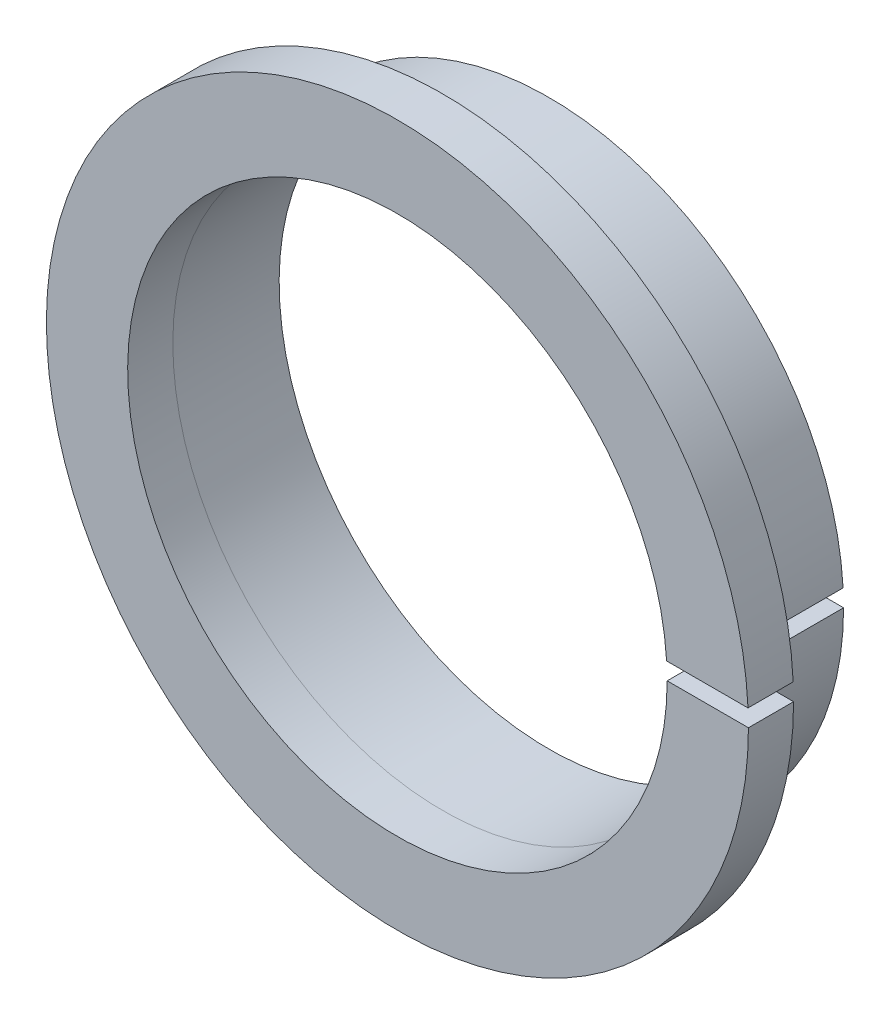
ISO-10303-21;
HEADER;
FILE_DESCRIPTION(('STEP AP214'),'2;1');
FILE_NAME('part.step','',(''),(''),'','','');
FILE_SCHEMA(('AUTOMOTIVE_DESIGN { 1 0 10303 214 1 1 1 1 }'));
ENDSEC;
DATA;
#1=APPLICATION_CONTEXT('core data for automotive mechanical design processes');
#2=APPLICATION_PROTOCOL_DEFINITION('international standard','automotive_design',2000,#1);
#3=PRODUCT_CONTEXT('',#1,'mechanical');
#4=PRODUCT('Part','Part','',(#3));
#5=PRODUCT_RELATED_PRODUCT_CATEGORY('part','',(#4));
#6=PRODUCT_DEFINITION_FORMATION('','',#4);
#7=PRODUCT_DEFINITION_CONTEXT('part definition',#1,'design');
#8=PRODUCT_DEFINITION('design','',#6,#7);
#9=PRODUCT_DEFINITION_SHAPE('','',#8);
#10=(LENGTH_UNIT() NAMED_UNIT(*) SI_UNIT(.MILLI.,.METRE.));
#11=(NAMED_UNIT(*) PLANE_ANGLE_UNIT() SI_UNIT($,.RADIAN.));
#12=(NAMED_UNIT(*) SI_UNIT($,.STERADIAN.) SOLID_ANGLE_UNIT());
#13=UNCERTAINTY_MEASURE_WITH_UNIT(LENGTH_MEASURE(1.E-05),#10,'distance_accuracy_value','');
#14=(GEOMETRIC_REPRESENTATION_CONTEXT(3) GLOBAL_UNCERTAINTY_ASSIGNED_CONTEXT((#13)) GLOBAL_UNIT_ASSIGNED_CONTEXT((#10,
#11,#12)) REPRESENTATION_CONTEXT('',''));
#15=CARTESIAN_POINT('',(0.,0.,0.));
#16=DIRECTION('',(0.,0.,1.));
#17=DIRECTION('',(1.,0.,0.));
#18=AXIS2_PLACEMENT_3D('',#15,#16,#17);
#19=CARTESIAN_POINT('',(-7.76463886416334E-06,-3.62104967429992E-07,-6.71));
#20=DIRECTION('',(0.,0.,1.));
#21=DIRECTION('',(1.,0.,0.));
#22=AXIS2_PLACEMENT_3D('',#19,#20,#21);
#23=CYLINDRICAL_SURFACE('',#22,11.9494490659713);
#24=CARTESIAN_POINT('',(-7.76463886416334E-06,-3.62104967429992E-07,-2.));
#25=DIRECTION('',(0.,0.,1.));
#26=DIRECTION('',(-1.,0.,0.));
#27=AXIS2_PLACEMENT_3D('',#24,#25,#26);
#28=CIRCLE('',#27,11.9494490659713);
#29=CARTESIAN_POINT('',(11.9258810776966,0.750005171541773,-2.));
#30=VERTEX_POINT('',#29);
#31=CARTESIAN_POINT('',(11.9494413013192,-1.81089741319822E-05,-2.));
#32=VERTEX_POINT('',#31);
#33=EDGE_CURVE('E112',#30,#32,#28,.T.);
#34=ORIENTED_EDGE('',*,*,#33,.T.);
#35=DIRECTION('',(0.,0.,1.));
#36=VECTOR('',#35,1.);
#37=CARTESIAN_POINT('',(11.9494413013192,-1.81089741319822E-05,-6.71));
#38=LINE('',#37,#36);
#39=CARTESIAN_POINT('',(11.9494413013192,-1.81089741319822E-05,-6.71));
#40=VERTEX_POINT('',#39);
#41=EDGE_CURVE('E12',#40,#32,#38,.T.);
#42=ORIENTED_EDGE('',*,*,#41,.F.);
#43=CARTESIAN_POINT('',(-7.76463886416334E-06,-3.62104967429992E-07,-6.71));
#44=DIRECTION('',(0.,0.,1.));
#45=DIRECTION('',(-1.,0.,0.));
#46=AXIS2_PLACEMENT_3D('',#43,#44,#45);
#47=CIRCLE('',#46,11.9494490659713);
#48=CARTESIAN_POINT('',(11.9258810776966,0.750005171541773,-6.71));
#49=VERTEX_POINT('',#48);
#50=EDGE_CURVE('E100',#49,#40,#47,.T.);
#51=ORIENTED_EDGE('',*,*,#50,.F.);
#52=DIRECTION('',(0.,0.,1.));
#53=VECTOR('',#52,1.);
#54=CARTESIAN_POINT('',(11.9258810776966,0.750005171541773,-6.71));
#55=LINE('',#54,#53);
#56=EDGE_CURVE('E108',#49,#30,#55,.T.);
#57=ORIENTED_EDGE('',*,*,#56,.T.);
#58=EDGE_LOOP('',(#34,#42,#51,#57));
#59=FACE_BOUND('',#58,.T.);
#60=ADVANCED_FACE('F49',(#59),#23,.F.);
#61=CARTESIAN_POINT('',(11.9494413013192,-1.81089741319822E-05,-6.71));
#62=DIRECTION('',(3.32628725026178E-05,-0.999999999446791,0.));
#63=DIRECTION('',(0.999999999446791,3.32628725026178E-05,0.));
#64=AXIS2_PLACEMENT_3D('',#61,#62,#63);
#65=PLANE('',#64);
#66=DIRECTION('',(0.999999999446791,3.32628725026178E-05,0.));
#67=VECTOR('',#66,1.);
#68=CARTESIAN_POINT('',(11.9494413013192,-1.81089741319822E-05,-2.));
#69=LINE('',#68,#67);
#70=CARTESIAN_POINT('',(13.0543939142499,1.86449237736986E-05,-2.));
#71=VERTEX_POINT('',#70);
#72=EDGE_CURVE('E104',#32,#71,#69,.T.);
#73=ORIENTED_EDGE('',*,*,#72,.T.);
#74=DIRECTION('',(0.,0.,1.));
#75=VECTOR('',#74,1.);
#76=CARTESIAN_POINT('',(13.0543939142499,1.86449237736986E-05,-6.71));
#77=LINE('',#76,#75);
#78=CARTESIAN_POINT('',(13.0543939142499,1.86449237736986E-05,-6.71));
#79=VERTEX_POINT('',#78);
#80=EDGE_CURVE('E57',#79,#71,#77,.T.);
#81=ORIENTED_EDGE('',*,*,#80,.F.);
#82=DIRECTION('',(0.999999999446791,3.32628725026178E-05,0.));
#83=VECTOR('',#82,1.);
#84=CARTESIAN_POINT('',(11.9494413013192,-1.81089741319822E-05,-6.71));
#85=LINE('',#84,#83);
#86=EDGE_CURVE('E95',#40,#79,#85,.T.);
#87=ORIENTED_EDGE('',*,*,#86,.F.);
#88=ORIENTED_EDGE('',*,*,#41,.T.);
#89=EDGE_LOOP('',(#73,#81,#87,#88));
#90=FACE_BOUND('',#89,.T.);
#91=ADVANCED_FACE('F103',(#90),#65,.F.);
#92=CARTESIAN_POINT('',(-8.76366281338057E-06,-4.04738164502353E-07,-6.71));
#93=DIRECTION('',(0.,0.,1.));
#94=DIRECTION('',(1.,0.,0.));
#95=AXIS2_PLACEMENT_3D('',#92,#93,#94);
#96=CYLINDRICAL_SURFACE('',#95,13.0544026779266);
#97=CARTESIAN_POINT('',(-8.76366281338057E-06,-4.04738164502353E-07,-2.));
#98=DIRECTION('',(0.,0.,-1.));
#99=DIRECTION('',(-1.,0.,0.));
#100=AXIS2_PLACEMENT_3D('',#97,#98,#99);
#101=CIRCLE('',#100,13.0544026779266);
#102=CARTESIAN_POINT('',(13.0328292112691,0.750041991816418,-2.));
#103=VERTEX_POINT('',#102);
#104=EDGE_CURVE('E82',#71,#103,#101,.T.);
#105=ORIENTED_EDGE('',*,*,#104,.T.);
#106=DIRECTION('',(0.,0.,1.));
#107=VECTOR('',#106,1.);
#108=CARTESIAN_POINT('',(13.0328292112691,0.750041991816418,-6.71));
#109=LINE('',#108,#107);
#110=CARTESIAN_POINT('',(13.0328292112691,0.750041991816418,-6.71));
#111=VERTEX_POINT('',#110);
#112=EDGE_CURVE('E105',#111,#103,#109,.T.);
#113=ORIENTED_EDGE('',*,*,#112,.F.);
#114=CARTESIAN_POINT('',(-8.76366281338057E-06,-4.04738164502353E-07,-6.71));
#115=DIRECTION('',(0.,0.,-1.));
#116=DIRECTION('',(-1.,0.,0.));
#117=AXIS2_PLACEMENT_3D('',#114,#115,#116);
#118=CIRCLE('',#117,13.0544026779266);
#119=EDGE_CURVE('E98',#79,#111,#118,.T.);
#120=ORIENTED_EDGE('',*,*,#119,.F.);
#121=ORIENTED_EDGE('',*,*,#80,.T.);
#122=EDGE_LOOP('',(#105,#113,#120,#121));
#123=FACE_BOUND('',#122,.T.);
#124=ADVANCED_FACE('F106',(#123),#96,.T.);
#125=CARTESIAN_POINT('',(13.0328292112691,0.750041991816428,-6.71));
#126=DIRECTION('',(-3.32628725027403E-05,0.999999999446791,0.));
#127=DIRECTION('',(-0.999999999446791,-3.32628725027403E-05,0.));
#128=AXIS2_PLACEMENT_3D('',#125,#126,#127);
#129=PLANE('',#128);
#130=DIRECTION('',(-0.999999999446791,-3.32628725027403E-05,0.));
#131=VECTOR('',#130,1.);
#132=CARTESIAN_POINT('',(13.0328292112691,0.750041991816428,-2.));
#133=LINE('',#132,#131);
#134=EDGE_CURVE('E88',#103,#30,#133,.T.);
#135=ORIENTED_EDGE('',*,*,#134,.T.);
#136=ORIENTED_EDGE('',*,*,#56,.F.);
#137=DIRECTION('',(-0.999999999446791,-3.32628725027403E-05,0.));
#138=VECTOR('',#137,1.);
#139=CARTESIAN_POINT('',(13.0328292112691,0.750041991816428,-6.71));
#140=LINE('',#139,#138);
#141=EDGE_CURVE('E65',#111,#49,#140,.T.);
#142=ORIENTED_EDGE('',*,*,#141,.F.);
#143=ORIENTED_EDGE('',*,*,#112,.T.);
#144=EDGE_LOOP('',(#135,#136,#142,#143));
#145=FACE_BOUND('',#144,.T.);
#146=ADVANCED_FACE('F119',(#145),#129,.F.);
#147=CARTESIAN_POINT('',(-7.76463886416334E-06,-3.62104967429992E-07,-6.71));
#148=DIRECTION('',(0.,0.,-1.));
#149=DIRECTION('',(-1.,0.,0.));
#150=AXIS2_PLACEMENT_3D('',#147,#148,#149);
#151=PLANE('',#150);
#152=ORIENTED_EDGE('',*,*,#50,.T.);
#153=ORIENTED_EDGE('',*,*,#86,.T.);
#154=ORIENTED_EDGE('',*,*,#119,.T.);
#155=ORIENTED_EDGE('',*,*,#141,.T.);
#156=EDGE_LOOP('',(#152,#153,#154,#155));
#157=FACE_BOUND('',#156,.T.);
#158=ADVANCED_FACE('F96',(#157),#151,.T.);
#159=CARTESIAN_POINT('',(-7.76463886416334E-06,-3.62104967429992E-07,-2.));
#160=DIRECTION('',(0.,0.,-1.));
#161=DIRECTION('',(-1.,0.,0.));
#162=AXIS2_PLACEMENT_3D('',#159,#160,#161);
#163=PLANE('',#162);
#164=ORIENTED_EDGE('',*,*,#33,.F.);
#165=ORIENTED_EDGE('',*,*,#134,.F.);
#166=ORIENTED_EDGE('',*,*,#104,.F.);
#167=ORIENTED_EDGE('',*,*,#72,.F.);
#168=EDGE_LOOP('',(#164,#165,#166,#167));
#169=FACE_BOUND('',#168,.T.);
#170=ADVANCED_FACE('F122',(#169),#163,.F.);
#171=CLOSED_SHELL('',(#60,#91,#124,#146,#158,#170));
#172=MANIFOLD_SOLID_BREP('B2',#171);
#173=CARTESIAN_POINT('',(2.76428622628616E-06,1.47163599611543E-07,-2.));
#174=DIRECTION('',(0.,0.,1.));
#175=DIRECTION('',(1.,0.,0.));
#176=AXIS2_PLACEMENT_3D('',#173,#174,#175);
#177=CYLINDRICAL_SURFACE('',#176,11.9494490659712);
#178=CARTESIAN_POINT('',(2.76428622628616E-06,1.47163599611543E-07,0.));
#179=DIRECTION('',(0.,0.,-1.));
#180=DIRECTION('',(1.,0.,0.));
#181=AXIS2_PLACEMENT_3D('',#178,#179,#180);
#182=CIRCLE('',#181,11.9494490659712);
#183=CARTESIAN_POINT('',(11.9494518302197,-2.99145378859221E-05,0.));
#184=VERTEX_POINT('',#183);
#185=CARTESIAN_POINT('',(11.9258916015962,0.75000576072042,0.));
#186=VERTEX_POINT('',#185);
#187=EDGE_CURVE('E237',#184,#186,#182,.T.);
#188=ORIENTED_EDGE('',*,*,#187,.F.);
#189=DIRECTION('',(0.,0.,1.));
#190=VECTOR('',#189,1.);
#191=CARTESIAN_POINT('',(11.9494518302197,-2.99145378859221E-05,-2.));
#192=LINE('',#191,#190);
#193=CARTESIAN_POINT('',(11.9494518302197,-2.99145378859221E-05,-2.));
#194=VERTEX_POINT('',#193);
#195=EDGE_CURVE('E47',#194,#184,#192,.T.);
#196=ORIENTED_EDGE('',*,*,#195,.F.);
#197=CARTESIAN_POINT('',(2.76428622628616E-06,1.47163599611543E-07,-2.));
#198=DIRECTION('',(0.,0.,-1.));
#199=DIRECTION('',(1.,0.,0.));
#200=AXIS2_PLACEMENT_3D('',#197,#198,#199);
#201=CIRCLE('',#200,11.9494490659712);
#202=CARTESIAN_POINT('',(11.9258916015962,0.75000576072042,-2.));
#203=VERTEX_POINT('',#202);
#204=EDGE_CURVE('E231',#194,#203,#201,.T.);
#205=ORIENTED_EDGE('',*,*,#204,.T.);
#206=DIRECTION('',(0.,0.,1.));
#207=VECTOR('',#206,1.);
#208=CARTESIAN_POINT('',(11.9258916015962,0.75000576072042,-2.));
#209=LINE('',#208,#207);
#210=EDGE_CURVE('E176',#203,#186,#209,.T.);
#211=ORIENTED_EDGE('',*,*,#210,.T.);
#212=EDGE_LOOP('',(#188,#196,#205,#211));
#213=FACE_BOUND('',#212,.T.);
#214=ADVANCED_FACE('F173',(#213),#177,.F.);
#215=CARTESIAN_POINT('',(15.549275935477,3.06147977789909E-05,-2.));
#216=DIRECTION('',(-1.68145259008508E-05,0.999999999858636,0.));
#217=DIRECTION('',(-0.999999999858636,-1.68145259008508E-05,0.));
#218=AXIS2_PLACEMENT_3D('',#215,#216,#217);
#219=PLANE('',#218);
#220=DIRECTION('',(-0.999999999858636,-1.68145259008508E-05,0.));
#221=VECTOR('',#220,1.);
#222=CARTESIAN_POINT('',(15.549275935477,3.06147977789909E-05,0.));
#223=LINE('',#222,#221);
#224=CARTESIAN_POINT('',(15.549275935477,3.0614797776476E-05,0.));
#225=VERTEX_POINT('',#224);
#226=EDGE_CURVE('E233',#225,#184,#223,.T.);
#227=ORIENTED_EDGE('',*,*,#226,.F.);
#228=DIRECTION('',(0.,0.,1.));
#229=VECTOR('',#228,1.);
#230=CARTESIAN_POINT('',(15.549275935477,3.0614797776476E-05,-2.));
#231=LINE('',#230,#229);
#232=CARTESIAN_POINT('',(15.549275935477,3.0614797776476E-05,-2.));
#233=VERTEX_POINT('',#232);
#234=EDGE_CURVE('E182',#233,#225,#231,.T.);
#235=ORIENTED_EDGE('',*,*,#234,.F.);
#236=DIRECTION('',(-0.999999999858636,-1.68145259008508E-05,0.));
#237=VECTOR('',#236,1.);
#238=CARTESIAN_POINT('',(15.549275935477,3.06147977789909E-05,-2.));
#239=LINE('',#238,#237);
#240=EDGE_CURVE('E228',#233,#194,#239,.T.);
#241=ORIENTED_EDGE('',*,*,#240,.T.);
#242=ORIENTED_EDGE('',*,*,#195,.T.);
#243=EDGE_LOOP('',(#227,#235,#241,#242));
#244=FACE_BOUND('',#243,.T.);
#245=ADVANCED_FACE('F247',(#244),#219,.T.);
#246=CARTESIAN_POINT('',(-8.76366281338057E-06,-4.04738164502353E-07,-2.));
#247=DIRECTION('',(0.,0.,1.));
#248=DIRECTION('',(1.,0.,0.));
#249=AXIS2_PLACEMENT_3D('',#246,#247,#248);
#250=CYLINDRICAL_SURFACE('',#249,15.5492846991707);
#251=CARTESIAN_POINT('',(-8.76366281338057E-06,-4.04738164502353E-07,0.));
#252=DIRECTION('',(0.,0.,1.));
#253=DIRECTION('',(1.,0.,0.));
#254=AXIS2_PLACEMENT_3D('',#251,#252,#253);
#255=CIRCLE('',#254,15.5492846991707);
#256=CARTESIAN_POINT('',(15.53117452904,0.750066381843592,0.));
#257=VERTEX_POINT('',#256);
#258=EDGE_CURVE('E223',#257,#225,#255,.T.);
#259=ORIENTED_EDGE('',*,*,#258,.F.);
#260=DIRECTION('',(0.,0.,1.));
#261=VECTOR('',#260,1.);
#262=CARTESIAN_POINT('',(15.53117452904,0.750066381843592,-2.));
#263=LINE('',#262,#261);
#264=CARTESIAN_POINT('',(15.53117452904,0.750066381843592,-2.));
#265=VERTEX_POINT('',#264);
#266=EDGE_CURVE('E218',#265,#257,#263,.T.);
#267=ORIENTED_EDGE('',*,*,#266,.F.);
#268=CARTESIAN_POINT('',(-8.76366281338057E-06,-4.04738164502353E-07,-2.));
#269=DIRECTION('',(0.,0.,1.));
#270=DIRECTION('',(1.,0.,0.));
#271=AXIS2_PLACEMENT_3D('',#268,#269,#270);
#272=CIRCLE('',#271,15.5492846991707);
#273=EDGE_CURVE('E221',#265,#233,#272,.T.);
#274=ORIENTED_EDGE('',*,*,#273,.T.);
#275=ORIENTED_EDGE('',*,*,#234,.T.);
#276=EDGE_LOOP('',(#259,#267,#274,#275));
#277=FACE_BOUND('',#276,.T.);
#278=ADVANCED_FACE('F220',(#277),#250,.T.);
#279=CARTESIAN_POINT('',(11.9258916015962,0.75000576072042,-2.));
#280=DIRECTION('',(1.68145259007283E-05,-0.999999999858636,0.));
#281=DIRECTION('',(0.999999999858636,1.68145259007283E-05,0.));
#282=AXIS2_PLACEMENT_3D('',#279,#280,#281);
#283=PLANE('',#282);
#284=DIRECTION('',(0.999999999858636,1.68145259007283E-05,0.));
#285=VECTOR('',#284,1.);
#286=CARTESIAN_POINT('',(11.9258916015962,0.75000576072042,0.));
#287=LINE('',#286,#285);
#288=EDGE_CURVE('E240',#186,#257,#287,.T.);
#289=ORIENTED_EDGE('',*,*,#288,.F.);
#290=ORIENTED_EDGE('',*,*,#210,.F.);
#291=DIRECTION('',(0.999999999858636,1.68145259007283E-05,0.));
#292=VECTOR('',#291,1.);
#293=CARTESIAN_POINT('',(11.9258916015962,0.75000576072042,-2.));
#294=LINE('',#293,#292);
#295=EDGE_CURVE('E227',#203,#265,#294,.T.);
#296=ORIENTED_EDGE('',*,*,#295,.T.);
#297=ORIENTED_EDGE('',*,*,#266,.T.);
#298=EDGE_LOOP('',(#289,#290,#296,#297));
#299=FACE_BOUND('',#298,.T.);
#300=ADVANCED_FACE('F230',(#299),#283,.T.);
#301=CARTESIAN_POINT('',(2.76428622628616E-06,1.47163599611543E-07,-2.));
#302=DIRECTION('',(0.,0.,1.));
#303=DIRECTION('',(1.,0.,0.));
#304=AXIS2_PLACEMENT_3D('',#301,#302,#303);
#305=PLANE('',#304);
#306=ORIENTED_EDGE('',*,*,#204,.F.);
#307=ORIENTED_EDGE('',*,*,#240,.F.);
#308=ORIENTED_EDGE('',*,*,#273,.F.);
#309=ORIENTED_EDGE('',*,*,#295,.F.);
#310=EDGE_LOOP('',(#306,#307,#308,#309));
#311=FACE_BOUND('',#310,.T.);
#312=ADVANCED_FACE('F226',(#311),#305,.F.);
#313=CARTESIAN_POINT('',(2.76428622628616E-06,1.47163599611543E-07,0.));
#314=DIRECTION('',(0.,0.,1.));
#315=DIRECTION('',(1.,0.,0.));
#316=AXIS2_PLACEMENT_3D('',#313,#314,#315);
#317=PLANE('',#316);
#318=ORIENTED_EDGE('',*,*,#187,.T.);
#319=ORIENTED_EDGE('',*,*,#288,.T.);
#320=ORIENTED_EDGE('',*,*,#258,.T.);
#321=ORIENTED_EDGE('',*,*,#226,.T.);
#322=EDGE_LOOP('',(#318,#319,#320,#321));
#323=FACE_BOUND('',#322,.T.);
#324=ADVANCED_FACE('F246',(#323),#317,.T.);
#325=CLOSED_SHELL('',(#214,#245,#278,#300,#312,#324));
#326=MANIFOLD_SOLID_BREP('B6',#325);
#327=ADVANCED_BREP_SHAPE_REPRESENTATION('',(#18,#172,#326),#14);
#328=SHAPE_DEFINITION_REPRESENTATION(#9,#327);
ENDSEC;
END-ISO-10303-21;
